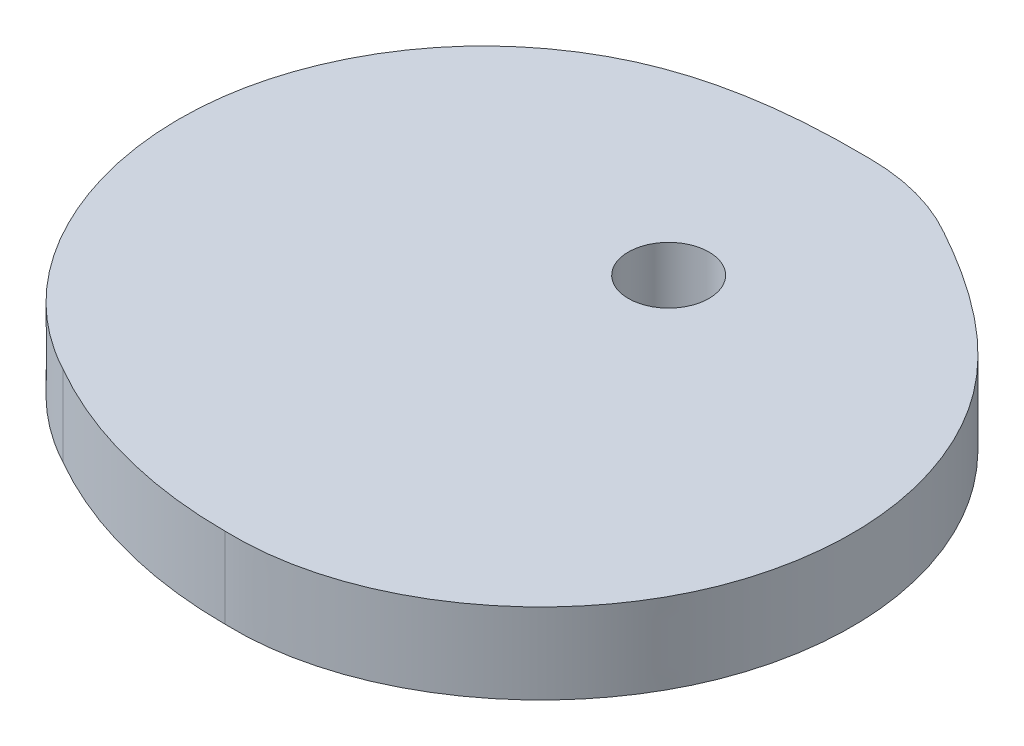
ISO-10303-21;
HEADER;
FILE_DESCRIPTION(('STEP AP214'),'2;1');
FILE_NAME('part.step','',(''),(''),'','','');
FILE_SCHEMA(('AUTOMOTIVE_DESIGN { 1 0 10303 214 1 1 1 1 }'));
ENDSEC;
DATA;
#1=APPLICATION_CONTEXT('core data for automotive mechanical design processes');
#2=APPLICATION_PROTOCOL_DEFINITION('international standard','automotive_design',2000,#1);
#3=PRODUCT_CONTEXT('',#1,'mechanical');
#4=PRODUCT('Part','Part','',(#3));
#5=PRODUCT_RELATED_PRODUCT_CATEGORY('part','',(#4));
#6=PRODUCT_DEFINITION_FORMATION('','',#4);
#7=PRODUCT_DEFINITION_CONTEXT('part definition',#1,'design');
#8=PRODUCT_DEFINITION('design','',#6,#7);
#9=PRODUCT_DEFINITION_SHAPE('','',#8);
#10=(LENGTH_UNIT() NAMED_UNIT(*) SI_UNIT(.MILLI.,.METRE.));
#11=(NAMED_UNIT(*) PLANE_ANGLE_UNIT() SI_UNIT($,.RADIAN.));
#12=(NAMED_UNIT(*) SI_UNIT($,.STERADIAN.) SOLID_ANGLE_UNIT());
#13=UNCERTAINTY_MEASURE_WITH_UNIT(LENGTH_MEASURE(1.E-05),#10,'distance_accuracy_value','');
#14=(GEOMETRIC_REPRESENTATION_CONTEXT(3) GLOBAL_UNCERTAINTY_ASSIGNED_CONTEXT((#13)) GLOBAL_UNIT_ASSIGNED_CONTEXT((#10,
#11,#12)) REPRESENTATION_CONTEXT('',''));
#15=CARTESIAN_POINT('',(0.,0.,0.));
#16=DIRECTION('',(0.,0.,1.));
#17=DIRECTION('',(1.,0.,0.));
#18=AXIS2_PLACEMENT_3D('',#15,#16,#17);
#19=CARTESIAN_POINT('',(-44.5844354819854,10.,-0.120674048069125));
#20=DIRECTION('',(0.,-1.,0.));
#21=DIRECTION('',(0.,0.,-1.));
#22=AXIS2_PLACEMENT_3D('',#19,#20,#21);
#23=PLANE('',#22);
#24=CARTESIAN_POINT('',(0.,10.,-25.));
#25=CARTESIAN_POINT('',(-8.33519159706002,10.,-25.1358036657469));
#26=CARTESIAN_POINT('',(-23.1852090813322,10.,-23.8489296115641));
#27=CARTESIAN_POINT('',(-40.5362455461466,10.,-10.6088506363584));
#28=CARTESIAN_POINT('',(-52.258549707218,10.,16.1980698320357));
#29=CARTESIAN_POINT('',(-41.4630920946601,10.,40.1721917657738));
#30=CARTESIAN_POINT('',(-27.5,10.,47.6313972081441));
#31=B_SPLINE_CURVE_WITH_KNOTS('',3,(#24,#25,#26,#27,#28,#29,#30),.UNSPECIFIED.,.F.,.F.,(4,1,1,1,
4),(0.,0.233107378980716,0.392177621974836,0.578701074468507,1.),.UNSPECIFIED.);
#32=CARTESIAN_POINT('',(0.,10.,-25.));
#33=VERTEX_POINT('',#32);
#34=CARTESIAN_POINT('',(-27.5,10.,47.6313972081441));
#35=VERTEX_POINT('',#34);
#36=EDGE_CURVE('E90',#33,#35,#31,.T.);
#37=ORIENTED_EDGE('',*,*,#36,.T.);
#38=CARTESIAN_POINT('',(0.,10.,0.));
#39=DIRECTION('',(0.,1.,0.));
#40=DIRECTION('',(0.,0.,1.));
#41=AXIS2_PLACEMENT_3D('',#38,#39,#40);
#42=CIRCLE('',#41,55.);
#43=CARTESIAN_POINT('',(-3.81639164714898E-13,10.,55.));
#44=VERTEX_POINT('',#43);
#45=EDGE_CURVE('E85',#35,#44,#42,.T.);
#46=ORIENTED_EDGE('',*,*,#45,.T.);
#47=CARTESIAN_POINT('',(-3.81639164714898E-13,10.,55.));
#48=CARTESIAN_POINT('',(15.821995190542,10.,55.5216846421902));
#49=CARTESIAN_POINT('',(37.1581966953642,10.,40.1572148204265));
#50=CARTESIAN_POINT('',(40.4098437351863,10.,11.0805886170322));
#51=CARTESIAN_POINT('',(32.0034448622693,10.,-9.06117435601547));
#52=CARTESIAN_POINT('',(19.786389501338,10.,-17.6006487205448));
#53=CARTESIAN_POINT('',(12.5,10.,-21.650635094611));
#54=B_SPLINE_CURVE_WITH_KNOTS('',3,(#47,#48,#49,#50,#51,#52,#53),.UNSPECIFIED.,.F.,.F.,(4,1,1,1,
4),(0.,0.421298925531488,0.607822378025166,0.766892621019286,1.),.UNSPECIFIED.);
#55=CARTESIAN_POINT('',(12.5,10.,-21.650635094611));
#56=VERTEX_POINT('',#55);
#57=EDGE_CURVE('E88',#44,#56,#54,.T.);
#58=ORIENTED_EDGE('',*,*,#57,.T.);
#59=CARTESIAN_POINT('',(0.,10.,0.));
#60=DIRECTION('',(0.,1.,0.));
#61=DIRECTION('',(0.,0.,1.));
#62=AXIS2_PLACEMENT_3D('',#59,#60,#61);
#63=CIRCLE('',#62,25.);
#64=EDGE_CURVE('E55',#56,#33,#63,.T.);
#65=ORIENTED_EDGE('',*,*,#64,.T.);
#66=EDGE_LOOP('',(#37,#46,#58,#65));
#67=FACE_BOUND('',#66,.T.);
#68=CARTESIAN_POINT('',(0.,10.,0.));
#69=DIRECTION('',(0.,1.,0.));
#70=DIRECTION('',(0.,0.,1.));
#71=AXIS2_PLACEMENT_3D('',#68,#69,#70);
#72=CIRCLE('',#71,5.);
#73=CARTESIAN_POINT('',(0.,10.,5.));
#74=VERTEX_POINT('',#73);
#75=EDGE_CURVE('E134',#74,#74,#72,.T.);
#76=ORIENTED_EDGE('',*,*,#75,.F.);
#77=EDGE_LOOP('',(#76));
#78=FACE_BOUND('',#77,.T.);
#79=ADVANCED_FACE('F37',(#67,#78),#23,.F.);
#80=CARTESIAN_POINT('',(-44.5844354819854,0.,-0.120674048069125));
#81=DIRECTION('',(0.,-1.,0.));
#82=DIRECTION('',(0.,0.,-1.));
#83=AXIS2_PLACEMENT_3D('',#80,#81,#82);
#84=PLANE('',#83);
#85=CARTESIAN_POINT('',(0.,0.,-25.));
#86=CARTESIAN_POINT('',(-8.33519159706002,0.,-25.1358036657469));
#87=CARTESIAN_POINT('',(-23.1852090813322,0.,-23.8489296115641));
#88=CARTESIAN_POINT('',(-40.5362455461466,0.,-10.6088506363584));
#89=CARTESIAN_POINT('',(-52.258549707218,0.,16.1980698320357));
#90=CARTESIAN_POINT('',(-41.4630920946601,0.,40.1721917657738));
#91=CARTESIAN_POINT('',(-27.5,0.,47.6313972081441));
#92=B_SPLINE_CURVE_WITH_KNOTS('',3,(#85,#86,#87,#88,#89,#90,#91),.UNSPECIFIED.,.F.,.F.,(4,1,1,1,
4),(0.,0.233107378980716,0.392177621974836,0.578701074468507,1.),.UNSPECIFIED.);
#93=CARTESIAN_POINT('',(0.,0.,-25.));
#94=VERTEX_POINT('',#93);
#95=CARTESIAN_POINT('',(-27.5,0.,47.6313972081441));
#96=VERTEX_POINT('',#95);
#97=EDGE_CURVE('E140',#94,#96,#92,.T.);
#98=ORIENTED_EDGE('',*,*,#97,.F.);
#99=CARTESIAN_POINT('',(0.,0.,0.));
#100=DIRECTION('',(0.,1.,0.));
#101=DIRECTION('',(0.,0.,1.));
#102=AXIS2_PLACEMENT_3D('',#99,#100,#101);
#103=CIRCLE('',#102,25.);
#104=CARTESIAN_POINT('',(12.5,0.,-21.650635094611));
#105=VERTEX_POINT('',#104);
#106=EDGE_CURVE('E78',#105,#94,#103,.T.);
#107=ORIENTED_EDGE('',*,*,#106,.F.);
#108=CARTESIAN_POINT('',(-3.81639164714898E-13,0.,55.));
#109=CARTESIAN_POINT('',(15.821995190542,0.,55.5216846421902));
#110=CARTESIAN_POINT('',(37.1581966953642,0.,40.1572148204265));
#111=CARTESIAN_POINT('',(40.4098437351863,0.,11.0805886170322));
#112=CARTESIAN_POINT('',(32.0034448622693,0.,-9.06117435601547));
#113=CARTESIAN_POINT('',(19.786389501338,0.,-17.6006487205448));
#114=CARTESIAN_POINT('',(12.5,0.,-21.650635094611));
#115=B_SPLINE_CURVE_WITH_KNOTS('',3,(#108,#109,#110,#111,#112,#113,#114),.UNSPECIFIED.,.F.,.F.,
(4,1,1,1,4),(0.,0.421298925531488,0.607822378025166,0.766892621019286,1.),.UNSPECIFIED.);
#116=CARTESIAN_POINT('',(-3.81639164714898E-13,0.,55.));
#117=VERTEX_POINT('',#116);
#118=EDGE_CURVE('E72',#117,#105,#115,.T.);
#119=ORIENTED_EDGE('',*,*,#118,.F.);
#120=CARTESIAN_POINT('',(0.,0.,0.));
#121=DIRECTION('',(0.,1.,0.));
#122=DIRECTION('',(0.,0.,1.));
#123=AXIS2_PLACEMENT_3D('',#120,#121,#122);
#124=CIRCLE('',#123,55.);
#125=EDGE_CURVE('E94',#96,#117,#124,.T.);
#126=ORIENTED_EDGE('',*,*,#125,.F.);
#127=EDGE_LOOP('',(#98,#107,#119,#126));
#128=FACE_BOUND('',#127,.T.);
#129=CARTESIAN_POINT('',(0.,0.,0.));
#130=DIRECTION('',(0.,1.,0.));
#131=DIRECTION('',(0.,0.,1.));
#132=AXIS2_PLACEMENT_3D('',#129,#130,#131);
#133=CIRCLE('',#132,5.);
#134=CARTESIAN_POINT('',(0.,0.,5.));
#135=VERTEX_POINT('',#134);
#136=EDGE_CURVE('E137',#135,#135,#133,.T.);
#137=ORIENTED_EDGE('',*,*,#136,.T.);
#138=EDGE_LOOP('',(#137));
#139=FACE_BOUND('',#138,.T.);
#140=ADVANCED_FACE('F116',(#128,#139),#84,.T.);
#141=DIRECTION('',(0.,-1.,0.));
#142=VECTOR('',#141,1.);
#143=SURFACE_OF_LINEAR_EXTRUSION('',#31,#142);
#144=ORIENTED_EDGE('',*,*,#97,.T.);
#145=DIRECTION('',(0.,-1.,0.));
#146=VECTOR('',#145,1.);
#147=CARTESIAN_POINT('',(-27.5,10.,47.6313972081441));
#148=LINE('',#147,#146);
#149=EDGE_CURVE('E11',#35,#96,#148,.T.);
#150=ORIENTED_EDGE('',*,*,#149,.F.);
#151=ORIENTED_EDGE('',*,*,#36,.F.);
#152=DIRECTION('',(0.,-1.,0.));
#153=VECTOR('',#152,1.);
#154=CARTESIAN_POINT('',(0.,10.,-25.));
#155=LINE('',#154,#153);
#156=EDGE_CURVE('E98',#33,#94,#155,.T.);
#157=ORIENTED_EDGE('',*,*,#156,.T.);
#158=EDGE_LOOP('',(#144,#150,#151,#157));
#159=FACE_BOUND('',#158,.T.);
#160=ADVANCED_FACE('F39',(#159),#143,.F.);
#161=CARTESIAN_POINT('',(0.,10.,0.));
#162=DIRECTION('',(0.,-1.,0.));
#163=DIRECTION('',(0.,0.,-1.));
#164=AXIS2_PLACEMENT_3D('',#161,#162,#163);
#165=CYLINDRICAL_SURFACE('',#164,55.);
#166=ORIENTED_EDGE('',*,*,#125,.T.);
#167=DIRECTION('',(0.,-1.,0.));
#168=VECTOR('',#167,1.);
#169=CARTESIAN_POINT('',(-3.81639164714898E-13,10.,55.));
#170=LINE('',#169,#168);
#171=EDGE_CURVE('E47',#44,#117,#170,.T.);
#172=ORIENTED_EDGE('',*,*,#171,.F.);
#173=ORIENTED_EDGE('',*,*,#45,.F.);
#174=ORIENTED_EDGE('',*,*,#149,.T.);
#175=EDGE_LOOP('',(#166,#172,#173,#174));
#176=FACE_BOUND('',#175,.T.);
#177=ADVANCED_FACE('F93',(#176),#165,.T.);
#178=DIRECTION('',(0.,-1.,0.));
#179=VECTOR('',#178,1.);
#180=SURFACE_OF_LINEAR_EXTRUSION('',#54,#179);
#181=ORIENTED_EDGE('',*,*,#118,.T.);
#182=DIRECTION('',(0.,-1.,0.));
#183=VECTOR('',#182,1.);
#184=CARTESIAN_POINT('',(12.5,10.,-21.650635094611));
#185=LINE('',#184,#183);
#186=EDGE_CURVE('E95',#56,#105,#185,.T.);
#187=ORIENTED_EDGE('',*,*,#186,.F.);
#188=ORIENTED_EDGE('',*,*,#57,.F.);
#189=ORIENTED_EDGE('',*,*,#171,.T.);
#190=EDGE_LOOP('',(#181,#187,#188,#189));
#191=FACE_BOUND('',#190,.T.);
#192=ADVANCED_FACE('F96',(#191),#180,.F.);
#193=CARTESIAN_POINT('',(0.,10.,0.));
#194=DIRECTION('',(0.,-1.,0.));
#195=DIRECTION('',(0.,0.,-1.));
#196=AXIS2_PLACEMENT_3D('',#193,#194,#195);
#197=CYLINDRICAL_SURFACE('',#196,25.);
#198=ORIENTED_EDGE('',*,*,#106,.T.);
#199=ORIENTED_EDGE('',*,*,#156,.F.);
#200=ORIENTED_EDGE('',*,*,#64,.F.);
#201=ORIENTED_EDGE('',*,*,#186,.T.);
#202=EDGE_LOOP('',(#198,#199,#200,#201));
#203=FACE_BOUND('',#202,.T.);
#204=ADVANCED_FACE('F110',(#203),#197,.T.);
#205=CARTESIAN_POINT('',(0.,10.,0.));
#206=DIRECTION('',(0.,-1.,0.));
#207=DIRECTION('',(0.,0.,-1.));
#208=AXIS2_PLACEMENT_3D('',#205,#206,#207);
#209=CYLINDRICAL_SURFACE('',#208,5.);
#210=ORIENTED_EDGE('',*,*,#75,.T.);
#211=EDGE_LOOP('',(#210));
#212=FACE_BOUND('',#211,.T.);
#213=ORIENTED_EDGE('',*,*,#136,.F.);
#214=EDGE_LOOP('',(#213));
#215=FACE_BOUND('',#214,.T.);
#216=ADVANCED_FACE('F125',(#212,#215),#209,.F.);
#217=CLOSED_SHELL('',(#79,#140,#160,#177,#192,#204,#216));
#218=MANIFOLD_SOLID_BREP('B2',#217);
#219=ADVANCED_BREP_SHAPE_REPRESENTATION('',(#18,#218),#14);
#220=SHAPE_DEFINITION_REPRESENTATION(#9,#219);
ENDSEC;
END-ISO-10303-21;
